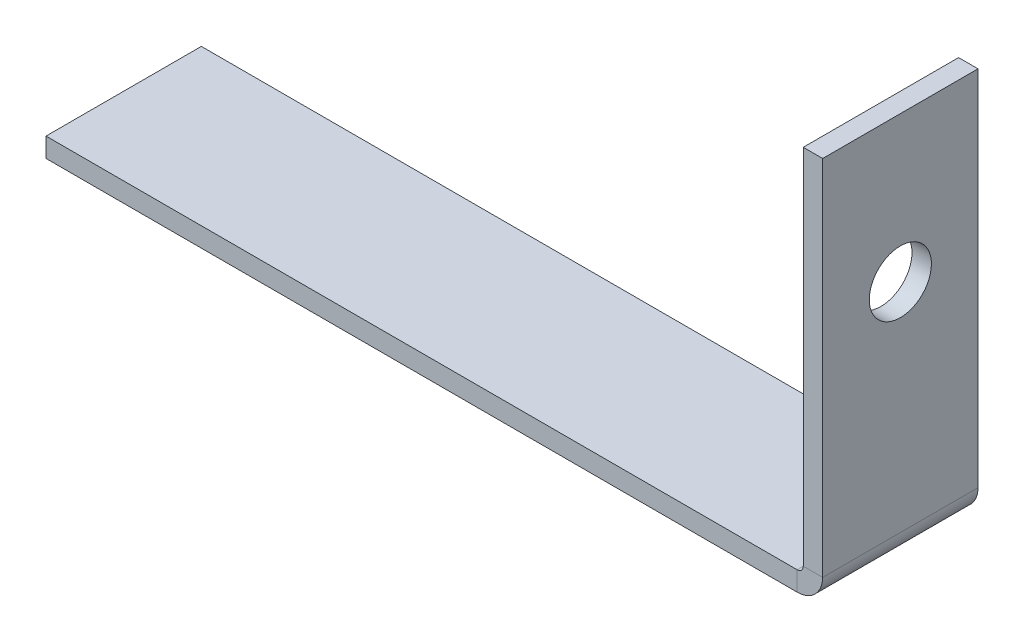
ISO-10303-21;
HEADER;
FILE_DESCRIPTION(('STEP AP214'),'2;1');
FILE_NAME('part.step','',(''),(''),'','','');
FILE_SCHEMA(('AUTOMOTIVE_DESIGN { 1 0 10303 214 1 1 1 1 }'));
ENDSEC;
DATA;
#1=APPLICATION_CONTEXT('core data for automotive mechanical design processes');
#2=APPLICATION_PROTOCOL_DEFINITION('international standard','automotive_design',2000,#1);
#3=PRODUCT_CONTEXT('',#1,'mechanical');
#4=PRODUCT('Part','Part','',(#3));
#5=PRODUCT_RELATED_PRODUCT_CATEGORY('part','',(#4));
#6=PRODUCT_DEFINITION_FORMATION('','',#4);
#7=PRODUCT_DEFINITION_CONTEXT('part definition',#1,'design');
#8=PRODUCT_DEFINITION('design','',#6,#7);
#9=PRODUCT_DEFINITION_SHAPE('','',#8);
#10=(LENGTH_UNIT() NAMED_UNIT(*) SI_UNIT(.MILLI.,.METRE.));
#11=(NAMED_UNIT(*) PLANE_ANGLE_UNIT() SI_UNIT($,.RADIAN.));
#12=(NAMED_UNIT(*) SI_UNIT($,.STERADIAN.) SOLID_ANGLE_UNIT());
#13=UNCERTAINTY_MEASURE_WITH_UNIT(LENGTH_MEASURE(1.E-05),#10,'distance_accuracy_value','');
#14=(GEOMETRIC_REPRESENTATION_CONTEXT(3) GLOBAL_UNCERTAINTY_ASSIGNED_CONTEXT((#13)) GLOBAL_UNIT_ASSIGNED_CONTEXT((#10,
#11,#12)) REPRESENTATION_CONTEXT('',''));
#15=CARTESIAN_POINT('',(0.,0.,0.));
#16=DIRECTION('',(0.,0.,1.));
#17=DIRECTION('',(1.,0.,0.));
#18=AXIS2_PLACEMENT_3D('',#15,#16,#17);
#19=CARTESIAN_POINT('',(0.,-3.175,-25.4));
#20=DIRECTION('',(0.,0.,-1.));
#21=DIRECTION('',(-1.,0.,0.));
#22=AXIS2_PLACEMENT_3D('',#19,#20,#21);
#23=PLANE('',#22);
#24=DIRECTION('',(-1.,0.,0.));
#25=VECTOR('',#24,1.);
#26=CARTESIAN_POINT('',(0.,0.,-25.4));
#27=LINE('',#26,#25);
#28=CARTESIAN_POINT('',(122.825,0.,-25.4));
#29=VERTEX_POINT('',#28);
#30=CARTESIAN_POINT('',(0.,0.,-25.4));
#31=VERTEX_POINT('',#30);
#32=EDGE_CURVE('E96',#29,#31,#27,.T.);
#33=ORIENTED_EDGE('',*,*,#32,.F.);
#34=DIRECTION('',(0.,-1.,0.));
#35=VECTOR('',#34,1.);
#36=CARTESIAN_POINT('',(122.825,0.,-25.4));
#37=LINE('',#36,#35);
#38=CARTESIAN_POINT('',(122.825,-3.175,-25.4));
#39=VERTEX_POINT('',#38);
#40=EDGE_CURVE('E114',#29,#39,#37,.T.);
#41=ORIENTED_EDGE('',*,*,#40,.T.);
#42=DIRECTION('',(-1.,0.,0.));
#43=VECTOR('',#42,1.);
#44=CARTESIAN_POINT('',(0.,-3.175,-25.4));
#45=LINE('',#44,#43);
#46=CARTESIAN_POINT('',(0.,-3.175,-25.4));
#47=VERTEX_POINT('',#46);
#48=EDGE_CURVE('E81',#39,#47,#45,.T.);
#49=ORIENTED_EDGE('',*,*,#48,.T.);
#50=DIRECTION('',(0.,1.,0.));
#51=VECTOR('',#50,1.);
#52=CARTESIAN_POINT('',(0.,-3.175,-25.4));
#53=LINE('',#52,#51);
#54=EDGE_CURVE('E13',#47,#31,#53,.T.);
#55=ORIENTED_EDGE('',*,*,#54,.T.);
#56=EDGE_LOOP('',(#33,#41,#49,#55));
#57=FACE_BOUND('',#56,.T.);
#58=ADVANCED_FACE('F58',(#57),#23,.T.);
#59=CARTESIAN_POINT('',(0.,-3.175,0.));
#60=DIRECTION('',(0.,-1.,0.));
#61=DIRECTION('',(0.,0.,-1.));
#62=AXIS2_PLACEMENT_3D('',#59,#60,#61);
#63=PLANE('',#62);
#64=ORIENTED_EDGE('',*,*,#48,.F.);
#65=DIRECTION('',(0.,0.,-1.));
#66=VECTOR('',#65,1.);
#67=CARTESIAN_POINT('',(122.825,-3.175,-25.4));
#68=LINE('',#67,#66);
#69=CARTESIAN_POINT('',(122.825,-3.175,0.));
#70=VERTEX_POINT('',#69);
#71=EDGE_CURVE('E134',#39,#70,#68,.F.);
#72=ORIENTED_EDGE('',*,*,#71,.T.);
#73=DIRECTION('',(1.,0.,0.));
#74=VECTOR('',#73,1.);
#75=CARTESIAN_POINT('',(0.,-3.175,0.));
#76=LINE('',#75,#74);
#77=CARTESIAN_POINT('',(0.,-3.175,0.));
#78=VERTEX_POINT('',#77);
#79=EDGE_CURVE('E118',#78,#70,#76,.T.);
#80=ORIENTED_EDGE('',*,*,#79,.F.);
#81=DIRECTION('',(0.,0.,1.));
#82=VECTOR('',#81,1.);
#83=CARTESIAN_POINT('',(0.,-3.175,0.));
#84=LINE('',#83,#82);
#85=EDGE_CURVE('E104',#47,#78,#84,.T.);
#86=ORIENTED_EDGE('',*,*,#85,.F.);
#87=EDGE_LOOP('',(#64,#72,#80,#86));
#88=FACE_BOUND('',#87,.T.);
#89=ADVANCED_FACE('F232',(#88),#63,.T.);
#90=CARTESIAN_POINT('',(0.,0.,0.));
#91=DIRECTION('',(0.,-1.,0.));
#92=DIRECTION('',(0.,0.,-1.));
#93=AXIS2_PLACEMENT_3D('',#90,#91,#92);
#94=PLANE('',#93);
#95=DIRECTION('',(0.,0.,-1.));
#96=VECTOR('',#95,1.);
#97=CARTESIAN_POINT('',(122.825,0.,-25.4));
#98=LINE('',#97,#96);
#99=CARTESIAN_POINT('',(122.825,0.,0.));
#100=VERTEX_POINT('',#99);
#101=EDGE_CURVE('E103',#29,#100,#98,.F.);
#102=ORIENTED_EDGE('',*,*,#101,.F.);
#103=ORIENTED_EDGE('',*,*,#32,.T.);
#104=DIRECTION('',(0.,0.,1.));
#105=VECTOR('',#104,1.);
#106=CARTESIAN_POINT('',(0.,0.,0.));
#107=LINE('',#106,#105);
#108=CARTESIAN_POINT('',(0.,0.,0.));
#109=VERTEX_POINT('',#108);
#110=EDGE_CURVE('E100',#31,#109,#107,.T.);
#111=ORIENTED_EDGE('',*,*,#110,.T.);
#112=DIRECTION('',(1.,0.,0.));
#113=VECTOR('',#112,1.);
#114=CARTESIAN_POINT('',(0.,0.,0.));
#115=LINE('',#114,#113);
#116=EDGE_CURVE('E105',#109,#100,#115,.T.);
#117=ORIENTED_EDGE('',*,*,#116,.T.);
#118=EDGE_LOOP('',(#102,#103,#111,#117));
#119=FACE_BOUND('',#118,.T.);
#120=ADVANCED_FACE('F97',(#119),#94,.F.);
#121=CARTESIAN_POINT('',(0.,-3.175,0.));
#122=DIRECTION('',(-1.,0.,0.));
#123=DIRECTION('',(0.,0.,1.));
#124=AXIS2_PLACEMENT_3D('',#121,#122,#123);
#125=PLANE('',#124);
#126=ORIENTED_EDGE('',*,*,#110,.F.);
#127=ORIENTED_EDGE('',*,*,#54,.F.);
#128=ORIENTED_EDGE('',*,*,#85,.T.);
#129=DIRECTION('',(0.,1.,0.));
#130=VECTOR('',#129,1.);
#131=CARTESIAN_POINT('',(0.,-3.175,0.));
#132=LINE('',#131,#130);
#133=EDGE_CURVE('E62',#78,#109,#132,.T.);
#134=ORIENTED_EDGE('',*,*,#133,.T.);
#135=EDGE_LOOP('',(#126,#127,#128,#134));
#136=FACE_BOUND('',#135,.T.);
#137=ADVANCED_FACE('F60',(#136),#125,.T.);
#138=CARTESIAN_POINT('',(0.,-3.175,0.));
#139=DIRECTION('',(0.,0.,1.));
#140=DIRECTION('',(1.,0.,0.));
#141=AXIS2_PLACEMENT_3D('',#138,#139,#140);
#142=PLANE('',#141);
#143=DIRECTION('',(0.,-1.,0.));
#144=VECTOR('',#143,1.);
#145=CARTESIAN_POINT('',(122.825,0.,0.));
#146=LINE('',#145,#144);
#147=EDGE_CURVE('E111',#100,#70,#146,.T.);
#148=ORIENTED_EDGE('',*,*,#147,.F.);
#149=ORIENTED_EDGE('',*,*,#116,.F.);
#150=ORIENTED_EDGE('',*,*,#133,.F.);
#151=ORIENTED_EDGE('',*,*,#79,.T.);
#152=EDGE_LOOP('',(#148,#149,#150,#151));
#153=FACE_BOUND('',#152,.T.);
#154=ADVANCED_FACE('F236',(#153),#142,.T.);
#155=CARTESIAN_POINT('',(122.825,1.,0.));
#156=DIRECTION('',(0.,0.,1.));
#157=DIRECTION('',(1.,0.,0.));
#158=AXIS2_PLACEMENT_3D('',#155,#156,#157);
#159=PLANE('',#158);
#160=DIRECTION('',(-1.,0.,0.));
#161=VECTOR('',#160,1.);
#162=CARTESIAN_POINT('',(127.,0.999999999999989,0.));
#163=LINE('',#162,#161);
#164=CARTESIAN_POINT('',(123.825,1.,0.));
#165=VERTEX_POINT('',#164);
#166=CARTESIAN_POINT('',(127.,0.999999999999989,0.));
#167=VERTEX_POINT('',#166);
#168=EDGE_CURVE('E138',#165,#167,#163,.F.);
#169=ORIENTED_EDGE('',*,*,#168,.F.);
#170=CARTESIAN_POINT('',(122.825,1.,0.));
#171=DIRECTION('',(0.,0.,-1.));
#172=DIRECTION('',(-1.,0.,0.));
#173=AXIS2_PLACEMENT_3D('',#170,#171,#172);
#174=CIRCLE('',#173,1.);
#175=EDGE_CURVE('E128',#100,#165,#174,.F.);
#176=ORIENTED_EDGE('',*,*,#175,.F.);
#177=ORIENTED_EDGE('',*,*,#147,.T.);
#178=CARTESIAN_POINT('',(122.825,1.,0.));
#179=DIRECTION('',(0.,0.,-1.));
#180=DIRECTION('',(-1.,0.,0.));
#181=AXIS2_PLACEMENT_3D('',#178,#179,#180);
#182=CIRCLE('',#181,4.175);
#183=EDGE_CURVE('E73',#70,#167,#182,.F.);
#184=ORIENTED_EDGE('',*,*,#183,.T.);
#185=EDGE_LOOP('',(#169,#176,#177,#184));
#186=FACE_BOUND('',#185,.T.);
#187=ADVANCED_FACE('F238',(#186),#159,.T.);
#188=CARTESIAN_POINT('',(122.825,1.,-25.4));
#189=DIRECTION('',(0.,0.,1.));
#190=DIRECTION('',(1.,0.,0.));
#191=AXIS2_PLACEMENT_3D('',#188,#189,#190);
#192=PLANE('',#191);
#193=CARTESIAN_POINT('',(122.825,1.,-25.4));
#194=DIRECTION('',(0.,0.,-1.));
#195=DIRECTION('',(-1.,0.,0.));
#196=AXIS2_PLACEMENT_3D('',#193,#194,#195);
#197=CIRCLE('',#196,1.);
#198=CARTESIAN_POINT('',(123.825,1.,-25.4));
#199=VERTEX_POINT('',#198);
#200=EDGE_CURVE('E123',#199,#29,#197,.T.);
#201=ORIENTED_EDGE('',*,*,#200,.F.);
#202=DIRECTION('',(-1.,0.,0.));
#203=VECTOR('',#202,1.);
#204=CARTESIAN_POINT('',(123.825,1.,-25.4));
#205=LINE('',#204,#203);
#206=CARTESIAN_POINT('',(127.,0.999999999999989,-25.4));
#207=VERTEX_POINT('',#206);
#208=EDGE_CURVE('E145',#199,#207,#205,.F.);
#209=ORIENTED_EDGE('',*,*,#208,.T.);
#210=CARTESIAN_POINT('',(122.825,1.,-25.4));
#211=DIRECTION('',(0.,0.,-1.));
#212=DIRECTION('',(-1.,0.,0.));
#213=AXIS2_PLACEMENT_3D('',#210,#211,#212);
#214=CIRCLE('',#213,4.175);
#215=EDGE_CURVE('E131',#207,#39,#214,.T.);
#216=ORIENTED_EDGE('',*,*,#215,.T.);
#217=ORIENTED_EDGE('',*,*,#40,.F.);
#218=EDGE_LOOP('',(#201,#209,#216,#217));
#219=FACE_BOUND('',#218,.T.);
#220=ADVANCED_FACE('F230',(#219),#192,.F.);
#221=CARTESIAN_POINT('',(122.825,1.,-25.4));
#222=DIRECTION('',(0.,0.,-1.));
#223=DIRECTION('',(1.,0.,0.));
#224=AXIS2_PLACEMENT_3D('',#221,#222,#223);
#225=CYLINDRICAL_SURFACE('',#224,4.175);
#226=ORIENTED_EDGE('',*,*,#71,.F.);
#227=ORIENTED_EDGE('',*,*,#215,.F.);
#228=DIRECTION('',(0.,0.,-1.));
#229=VECTOR('',#228,1.);
#230=CARTESIAN_POINT('',(127.,0.999999999999989,0.));
#231=LINE('',#230,#229);
#232=EDGE_CURVE('E148',#207,#167,#231,.F.);
#233=ORIENTED_EDGE('',*,*,#232,.T.);
#234=ORIENTED_EDGE('',*,*,#183,.F.);
#235=EDGE_LOOP('',(#226,#227,#233,#234));
#236=FACE_BOUND('',#235,.T.);
#237=ADVANCED_FACE('F313',(#236),#225,.T.);
#238=CARTESIAN_POINT('',(122.825,1.,-25.4));
#239=DIRECTION('',(0.,0.,-1.));
#240=DIRECTION('',(1.,0.,0.));
#241=AXIS2_PLACEMENT_3D('',#238,#239,#240);
#242=CYLINDRICAL_SURFACE('',#241,1.);
#243=ORIENTED_EDGE('',*,*,#101,.T.);
#244=ORIENTED_EDGE('',*,*,#175,.T.);
#245=DIRECTION('',(0.,0.,-1.));
#246=VECTOR('',#245,1.);
#247=CARTESIAN_POINT('',(123.825,1.,0.));
#248=LINE('',#247,#246);
#249=EDGE_CURVE('E141',#165,#199,#248,.T.);
#250=ORIENTED_EDGE('',*,*,#249,.T.);
#251=ORIENTED_EDGE('',*,*,#200,.T.);
#252=EDGE_LOOP('',(#243,#244,#250,#251));
#253=FACE_BOUND('',#252,.T.);
#254=ADVANCED_FACE('F225',(#253),#242,.F.);
#255=CARTESIAN_POINT('',(127.,60.325,-25.4));
#256=DIRECTION('',(0.,0.,1.));
#257=DIRECTION('',(0.,-1.,0.));
#258=AXIS2_PLACEMENT_3D('',#255,#256,#257);
#259=PLANE('',#258);
#260=ORIENTED_EDGE('',*,*,#208,.F.);
#261=DIRECTION('',(0.,-1.,0.));
#262=VECTOR('',#261,1.);
#263=CARTESIAN_POINT('',(123.825,60.325,-25.4));
#264=LINE('',#263,#262);
#265=CARTESIAN_POINT('',(123.825,60.325,-25.4));
#266=VERTEX_POINT('',#265);
#267=EDGE_CURVE('E150',#199,#266,#264,.F.);
#268=ORIENTED_EDGE('',*,*,#267,.T.);
#269=DIRECTION('',(-1.,0.,0.));
#270=VECTOR('',#269,1.);
#271=CARTESIAN_POINT('',(127.,60.325,-25.4));
#272=LINE('',#271,#270);
#273=CARTESIAN_POINT('',(127.,60.325,-25.4));
#274=VERTEX_POINT('',#273);
#275=EDGE_CURVE('E126',#274,#266,#272,.T.);
#276=ORIENTED_EDGE('',*,*,#275,.F.);
#277=DIRECTION('',(0.,1.,0.));
#278=VECTOR('',#277,1.);
#279=CARTESIAN_POINT('',(127.,-4.756261398703E-13,-25.4));
#280=LINE('',#279,#278);
#281=EDGE_CURVE('E159',#207,#274,#280,.T.);
#282=ORIENTED_EDGE('',*,*,#281,.F.);
#283=EDGE_LOOP('',(#260,#268,#276,#282));
#284=FACE_BOUND('',#283,.T.);
#285=ADVANCED_FACE('F199',(#284),#259,.F.);
#286=CARTESIAN_POINT('',(127.,0.,0.));
#287=DIRECTION('',(0.,0.,-1.));
#288=DIRECTION('',(-1.,0.,0.));
#289=AXIS2_PLACEMENT_3D('',#286,#287,#288);
#290=PLANE('',#289);
#291=ORIENTED_EDGE('',*,*,#168,.T.);
#292=DIRECTION('',(0.,-1.,0.));
#293=VECTOR('',#292,1.);
#294=CARTESIAN_POINT('',(127.,-4.78547779408788E-13,0.));
#295=LINE('',#294,#293);
#296=CARTESIAN_POINT('',(127.,60.325,0.));
#297=VERTEX_POINT('',#296);
#298=EDGE_CURVE('E165',#297,#167,#295,.T.);
#299=ORIENTED_EDGE('',*,*,#298,.F.);
#300=DIRECTION('',(-1.,0.,0.));
#301=VECTOR('',#300,1.);
#302=CARTESIAN_POINT('',(127.,60.325,0.));
#303=LINE('',#302,#301);
#304=CARTESIAN_POINT('',(123.825,60.325,0.));
#305=VERTEX_POINT('',#304);
#306=EDGE_CURVE('E168',#297,#305,#303,.T.);
#307=ORIENTED_EDGE('',*,*,#306,.T.);
#308=DIRECTION('',(0.,1.,0.));
#309=VECTOR('',#308,1.);
#310=CARTESIAN_POINT('',(123.825,0.,0.));
#311=LINE('',#310,#309);
#312=EDGE_CURVE('E156',#305,#165,#311,.F.);
#313=ORIENTED_EDGE('',*,*,#312,.T.);
#314=EDGE_LOOP('',(#291,#299,#307,#313));
#315=FACE_BOUND('',#314,.T.);
#316=ADVANCED_FACE('F185',(#315),#290,.F.);
#317=CARTESIAN_POINT('',(127.,-4.78547779408788E-13,0.));
#318=DIRECTION('',(-1.,0.,0.));
#319=DIRECTION('',(0.,-1.,0.));
#320=AXIS2_PLACEMENT_3D('',#317,#318,#319);
#321=PLANE('',#320);
#322=CARTESIAN_POINT('',(127.,36.5124999999976,-12.7));
#323=DIRECTION('',(1.,0.,0.));
#324=DIRECTION('',(0.,1.,0.));
#325=AXIS2_PLACEMENT_3D('',#322,#323,#324);
#326=CIRCLE('',#325,5.08000000000001);
#327=CARTESIAN_POINT('',(127.,41.5924999999976,-12.7));
#328=VERTEX_POINT('',#327);
#329=EDGE_CURVE('E142',#328,#328,#326,.T.);
#330=ORIENTED_EDGE('',*,*,#329,.F.);
#331=EDGE_LOOP('',(#330));
#332=FACE_BOUND('',#331,.T.);
#333=ORIENTED_EDGE('',*,*,#232,.F.);
#334=ORIENTED_EDGE('',*,*,#281,.T.);
#335=DIRECTION('',(0.,0.,1.));
#336=VECTOR('',#335,1.);
#337=CARTESIAN_POINT('',(127.,60.325,0.));
#338=LINE('',#337,#336);
#339=EDGE_CURVE('E162',#274,#297,#338,.T.);
#340=ORIENTED_EDGE('',*,*,#339,.T.);
#341=ORIENTED_EDGE('',*,*,#298,.T.);
#342=EDGE_LOOP('',(#333,#334,#340,#341));
#343=FACE_BOUND('',#342,.T.);
#344=ADVANCED_FACE('F181',(#332,#343),#321,.F.);
#345=CARTESIAN_POINT('',(123.825,-4.67462326157961E-13,0.));
#346=DIRECTION('',(-1.,0.,0.));
#347=DIRECTION('',(0.,-1.,0.));
#348=AXIS2_PLACEMENT_3D('',#345,#346,#347);
#349=PLANE('',#348);
#350=CARTESIAN_POINT('',(123.825,36.5124999999976,-12.7));
#351=DIRECTION('',(-1.,0.,0.));
#352=DIRECTION('',(0.,-1.,0.));
#353=AXIS2_PLACEMENT_3D('',#350,#351,#352);
#354=CIRCLE('',#353,5.08000000000001);
#355=CARTESIAN_POINT('',(123.825,31.4324999999976,-12.7));
#356=VERTEX_POINT('',#355);
#357=EDGE_CURVE('E173',#356,#356,#354,.F.);
#358=ORIENTED_EDGE('',*,*,#357,.T.);
#359=EDGE_LOOP('',(#358));
#360=FACE_BOUND('',#359,.T.);
#361=ORIENTED_EDGE('',*,*,#267,.F.);
#362=ORIENTED_EDGE('',*,*,#249,.F.);
#363=ORIENTED_EDGE('',*,*,#312,.F.);
#364=DIRECTION('',(0.,0.,-1.));
#365=VECTOR('',#364,1.);
#366=CARTESIAN_POINT('',(123.825,60.325,0.));
#367=LINE('',#366,#365);
#368=EDGE_CURVE('E153',#266,#305,#367,.F.);
#369=ORIENTED_EDGE('',*,*,#368,.F.);
#370=EDGE_LOOP('',(#361,#362,#363,#369));
#371=FACE_BOUND('',#370,.T.);
#372=ADVANCED_FACE('F184',(#360,#371),#349,.T.);
#373=CARTESIAN_POINT('',(127.,60.325,0.));
#374=DIRECTION('',(0.,-1.,0.));
#375=DIRECTION('',(1.,0.,0.));
#376=AXIS2_PLACEMENT_3D('',#373,#374,#375);
#377=PLANE('',#376);
#378=ORIENTED_EDGE('',*,*,#368,.T.);
#379=ORIENTED_EDGE('',*,*,#306,.F.);
#380=ORIENTED_EDGE('',*,*,#339,.F.);
#381=ORIENTED_EDGE('',*,*,#275,.T.);
#382=EDGE_LOOP('',(#378,#379,#380,#381));
#383=FACE_BOUND('',#382,.T.);
#384=ADVANCED_FACE('F209',(#383),#377,.F.);
#385=CARTESIAN_POINT('',(-0.00100000000008427,36.5124999999981,-12.7));
#386=DIRECTION('',(1.,0.,0.));
#387=DIRECTION('',(0.,1.,0.));
#388=AXIS2_PLACEMENT_3D('',#385,#386,#387);
#389=CYLINDRICAL_SURFACE('',#388,5.08000000000001);
#390=ORIENTED_EDGE('',*,*,#357,.F.);
#391=EDGE_LOOP('',(#390));
#392=FACE_BOUND('',#391,.T.);
#393=ORIENTED_EDGE('',*,*,#329,.T.);
#394=EDGE_LOOP('',(#393));
#395=FACE_BOUND('',#394,.T.);
#396=ADVANCED_FACE('F179',(#392,#395),#389,.F.);
#397=CLOSED_SHELL('',(#58,#89,#120,#137,#154,#187,#220,#237,#254,#285,#316,#344,#372,#384,#396));
#398=MANIFOLD_SOLID_BREP('B2',#397);
#399=ADVANCED_BREP_SHAPE_REPRESENTATION('',(#18,#398),#14);
#400=SHAPE_DEFINITION_REPRESENTATION(#9,#399);
ENDSEC;
END-ISO-10303-21;
